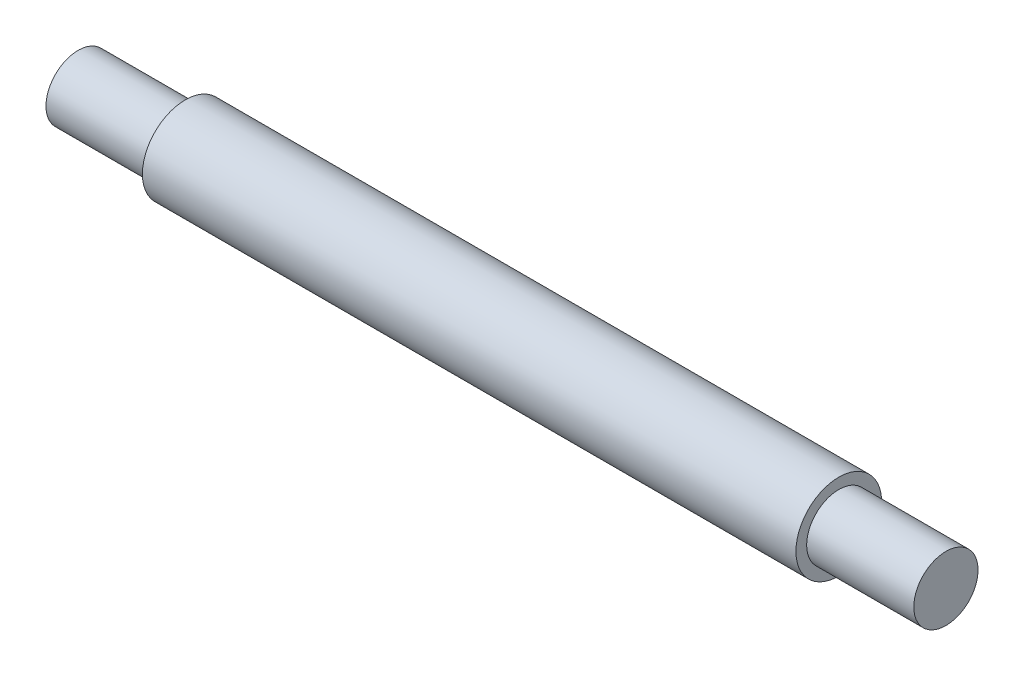
ISO-10303-21;
HEADER;
FILE_DESCRIPTION(('STEP AP214'),'2;1');
FILE_NAME('part.step','',(''),(''),'','','');
FILE_SCHEMA(('AUTOMOTIVE_DESIGN { 1 0 10303 214 1 1 1 1 }'));
ENDSEC;
DATA;
#1=APPLICATION_CONTEXT('core data for automotive mechanical design processes');
#2=APPLICATION_PROTOCOL_DEFINITION('international standard','automotive_design',2000,#1);
#3=PRODUCT_CONTEXT('',#1,'mechanical');
#4=PRODUCT('Part','Part','',(#3));
#5=PRODUCT_RELATED_PRODUCT_CATEGORY('part','',(#4));
#6=PRODUCT_DEFINITION_FORMATION('','',#4);
#7=PRODUCT_DEFINITION_CONTEXT('part definition',#1,'design');
#8=PRODUCT_DEFINITION('design','',#6,#7);
#9=PRODUCT_DEFINITION_SHAPE('','',#8);
#10=(LENGTH_UNIT() NAMED_UNIT(*) SI_UNIT(.MILLI.,.METRE.));
#11=(NAMED_UNIT(*) PLANE_ANGLE_UNIT() SI_UNIT($,.RADIAN.));
#12=(NAMED_UNIT(*) SI_UNIT($,.STERADIAN.) SOLID_ANGLE_UNIT());
#13=UNCERTAINTY_MEASURE_WITH_UNIT(LENGTH_MEASURE(1.E-05),#10,'distance_accuracy_value','');
#14=(GEOMETRIC_REPRESENTATION_CONTEXT(3) GLOBAL_UNCERTAINTY_ASSIGNED_CONTEXT((#13)) GLOBAL_UNIT_ASSIGNED_CONTEXT((#10,
#11,#12)) REPRESENTATION_CONTEXT('',''));
#15=CARTESIAN_POINT('',(0.,0.,0.));
#16=DIRECTION('',(0.,0.,1.));
#17=DIRECTION('',(1.,0.,0.));
#18=AXIS2_PLACEMENT_3D('',#15,#16,#17);
#19=CARTESIAN_POINT('',(-40.5,3.,0.));
#20=DIRECTION('',(1.,0.,0.));
#21=DIRECTION('',(0.,0.,-1.));
#22=AXIS2_PLACEMENT_3D('',#19,#20,#21);
#23=PLANE('',#22);
#24=CARTESIAN_POINT('',(-40.5,0.,0.));
#25=DIRECTION('',(-1.,0.,0.));
#26=DIRECTION('',(0.,0.,1.));
#27=AXIS2_PLACEMENT_3D('',#24,#25,#26);
#28=CIRCLE('',#27,3.);
#29=CARTESIAN_POINT('',(-40.5,0.,3.));
#30=VERTEX_POINT('',#29);
#31=EDGE_CURVE('E57',#30,#30,#28,.T.);
#32=ORIENTED_EDGE('',*,*,#31,.T.);
#33=EDGE_LOOP('',(#32));
#34=FACE_BOUND('',#33,.T.);
#35=ADVANCED_FACE('F35',(#34),#23,.F.);
#36=CARTESIAN_POINT('',(40.5,0.,0.));
#37=DIRECTION('',(-1.,0.,0.));
#38=DIRECTION('',(0.,0.,1.));
#39=AXIS2_PLACEMENT_3D('',#36,#37,#38);
#40=PLANE('',#39);
#41=CARTESIAN_POINT('',(40.5,0.,0.));
#42=DIRECTION('',(-1.,0.,0.));
#43=DIRECTION('',(0.,0.,1.));
#44=AXIS2_PLACEMENT_3D('',#41,#42,#43);
#45=CIRCLE('',#44,3.);
#46=CARTESIAN_POINT('',(40.5,0.,3.));
#47=VERTEX_POINT('',#46);
#48=EDGE_CURVE('E10',#47,#47,#45,.T.);
#49=ORIENTED_EDGE('',*,*,#48,.F.);
#50=EDGE_LOOP('',(#49));
#51=FACE_BOUND('',#50,.T.);
#52=ADVANCED_FACE('F87',(#51),#40,.F.);
#53=CARTESIAN_POINT('',(-73.2309644670051,0.,0.));
#54=DIRECTION('',(-1.,0.,0.));
#55=DIRECTION('',(0.,0.,1.));
#56=AXIS2_PLACEMENT_3D('',#53,#54,#55);
#57=CYLINDRICAL_SURFACE('',#56,3.);
#58=CARTESIAN_POINT('',(30.5,0.,0.));
#59=DIRECTION('',(-1.,0.,0.));
#60=DIRECTION('',(0.,0.,1.));
#61=AXIS2_PLACEMENT_3D('',#58,#59,#60);
#62=CIRCLE('',#61,3.);
#63=CARTESIAN_POINT('',(30.5,0.,3.));
#64=VERTEX_POINT('',#63);
#65=EDGE_CURVE('E41',#64,#64,#62,.T.);
#66=ORIENTED_EDGE('',*,*,#65,.F.);
#67=EDGE_LOOP('',(#66));
#68=FACE_BOUND('',#67,.T.);
#69=ORIENTED_EDGE('',*,*,#48,.T.);
#70=EDGE_LOOP('',(#69));
#71=FACE_BOUND('',#70,.T.);
#72=ADVANCED_FACE('F82',(#68,#71),#57,.T.);
#73=CARTESIAN_POINT('',(30.5,3.,0.));
#74=DIRECTION('',(-1.,0.,0.));
#75=DIRECTION('',(0.,0.,1.));
#76=AXIS2_PLACEMENT_3D('',#73,#74,#75);
#77=PLANE('',#76);
#78=CARTESIAN_POINT('',(30.5,0.,0.));
#79=DIRECTION('',(-1.,0.,0.));
#80=DIRECTION('',(0.,0.,1.));
#81=AXIS2_PLACEMENT_3D('',#78,#79,#80);
#82=CIRCLE('',#81,4.00000000000002);
#83=CARTESIAN_POINT('',(30.5,0.,4.00000000000002));
#84=VERTEX_POINT('',#83);
#85=EDGE_CURVE('E45',#84,#84,#82,.T.);
#86=ORIENTED_EDGE('',*,*,#85,.F.);
#87=EDGE_LOOP('',(#86));
#88=FACE_BOUND('',#87,.T.);
#89=ORIENTED_EDGE('',*,*,#65,.T.);
#90=EDGE_LOOP('',(#89));
#91=FACE_BOUND('',#90,.T.);
#92=ADVANCED_FACE('F77',(#88,#91),#77,.F.);
#93=CARTESIAN_POINT('',(-73.2309644670051,0.,0.));
#94=DIRECTION('',(-1.,0.,0.));
#95=DIRECTION('',(0.,0.,1.));
#96=AXIS2_PLACEMENT_3D('',#93,#94,#95);
#97=CYLINDRICAL_SURFACE('',#96,4.00000000000002);
#98=CARTESIAN_POINT('',(-30.5,0.,0.));
#99=DIRECTION('',(-1.,0.,0.));
#100=DIRECTION('',(0.,0.,1.));
#101=AXIS2_PLACEMENT_3D('',#98,#99,#100);
#102=CIRCLE('',#101,4.00000000000002);
#103=CARTESIAN_POINT('',(-30.5,0.,4.00000000000002));
#104=VERTEX_POINT('',#103);
#105=EDGE_CURVE('E49',#104,#104,#102,.T.);
#106=ORIENTED_EDGE('',*,*,#105,.F.);
#107=EDGE_LOOP('',(#106));
#108=FACE_BOUND('',#107,.T.);
#109=ORIENTED_EDGE('',*,*,#85,.T.);
#110=EDGE_LOOP('',(#109));
#111=FACE_BOUND('',#110,.T.);
#112=ADVANCED_FACE('F71',(#108,#111),#97,.T.);
#113=CARTESIAN_POINT('',(-30.5,4.00000000000002,0.));
#114=DIRECTION('',(1.,0.,0.));
#115=DIRECTION('',(0.,0.,-1.));
#116=AXIS2_PLACEMENT_3D('',#113,#114,#115);
#117=PLANE('',#116);
#118=CARTESIAN_POINT('',(-30.5,0.,0.));
#119=DIRECTION('',(-1.,0.,0.));
#120=DIRECTION('',(0.,0.,1.));
#121=AXIS2_PLACEMENT_3D('',#118,#119,#120);
#122=CIRCLE('',#121,3.);
#123=CARTESIAN_POINT('',(-30.5,0.,3.));
#124=VERTEX_POINT('',#123);
#125=EDGE_CURVE('E54',#124,#124,#122,.T.);
#126=ORIENTED_EDGE('',*,*,#125,.F.);
#127=EDGE_LOOP('',(#126));
#128=FACE_BOUND('',#127,.T.);
#129=ORIENTED_EDGE('',*,*,#105,.T.);
#130=EDGE_LOOP('',(#129));
#131=FACE_BOUND('',#130,.T.);
#132=ADVANCED_FACE('F65',(#128,#131),#117,.F.);
#133=CARTESIAN_POINT('',(-73.2309644670051,0.,0.));
#134=DIRECTION('',(-1.,0.,0.));
#135=DIRECTION('',(0.,0.,1.));
#136=AXIS2_PLACEMENT_3D('',#133,#134,#135);
#137=CYLINDRICAL_SURFACE('',#136,3.);
#138=ORIENTED_EDGE('',*,*,#31,.F.);
#139=EDGE_LOOP('',(#138));
#140=FACE_BOUND('',#139,.T.);
#141=ORIENTED_EDGE('',*,*,#125,.T.);
#142=EDGE_LOOP('',(#141));
#143=FACE_BOUND('',#142,.T.);
#144=ADVANCED_FACE('F62',(#140,#143),#137,.T.);
#145=CLOSED_SHELL('',(#35,#52,#72,#92,#112,#132,#144));
#146=MANIFOLD_SOLID_BREP('B2',#145);
#147=ADVANCED_BREP_SHAPE_REPRESENTATION('',(#18,#146),#14);
#148=SHAPE_DEFINITION_REPRESENTATION(#9,#147);
ENDSEC;
END-ISO-10303-21;
